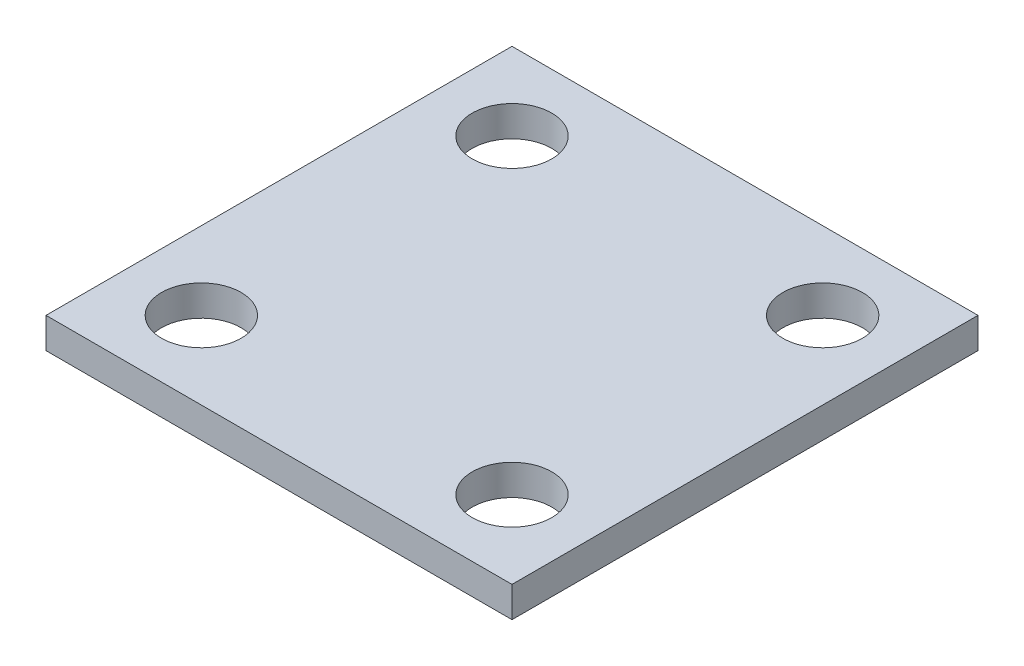
ISO-10303-21;
HEADER;
FILE_DESCRIPTION(('STEP AP214'),'2;1');
FILE_NAME('part.step','',(''),(''),'','','');
FILE_SCHEMA(('AUTOMOTIVE_DESIGN { 1 0 10303 214 1 1 1 1 }'));
ENDSEC;
DATA;
#1=APPLICATION_CONTEXT('core data for automotive mechanical design processes');
#2=APPLICATION_PROTOCOL_DEFINITION('international standard','automotive_design',2000,#1);
#3=PRODUCT_CONTEXT('',#1,'mechanical');
#4=PRODUCT('Part','Part','',(#3));
#5=PRODUCT_RELATED_PRODUCT_CATEGORY('part','',(#4));
#6=PRODUCT_DEFINITION_FORMATION('','',#4);
#7=PRODUCT_DEFINITION_CONTEXT('part definition',#1,'design');
#8=PRODUCT_DEFINITION('design','',#6,#7);
#9=PRODUCT_DEFINITION_SHAPE('','',#8);
#10=(LENGTH_UNIT() NAMED_UNIT(*) SI_UNIT(.MILLI.,.METRE.));
#11=(NAMED_UNIT(*) PLANE_ANGLE_UNIT() SI_UNIT($,.RADIAN.));
#12=(NAMED_UNIT(*) SI_UNIT($,.STERADIAN.) SOLID_ANGLE_UNIT());
#13=UNCERTAINTY_MEASURE_WITH_UNIT(LENGTH_MEASURE(1.E-05),#10,'distance_accuracy_value','');
#14=(GEOMETRIC_REPRESENTATION_CONTEXT(3) GLOBAL_UNCERTAINTY_ASSIGNED_CONTEXT((#13)) GLOBAL_UNIT_ASSIGNED_CONTEXT((#10,
#11,#12)) REPRESENTATION_CONTEXT('',''));
#15=CARTESIAN_POINT('',(0.,0.,0.));
#16=DIRECTION('',(0.,0.,1.));
#17=DIRECTION('',(1.,0.,0.));
#18=AXIS2_PLACEMENT_3D('',#15,#16,#17);
#19=CARTESIAN_POINT('',(0.,2.5,0.));
#20=DIRECTION('',(0.,1.,0.));
#21=DIRECTION('',(0.,0.,1.));
#22=AXIS2_PLACEMENT_3D('',#19,#20,#21);
#23=PLANE('',#22);
#24=CARTESIAN_POINT('',(-12.7,2.5,12.7));
#25=DIRECTION('',(0.,1.,0.));
#26=DIRECTION('',(0.,0.,-1.));
#27=AXIS2_PLACEMENT_3D('',#24,#25,#26);
#28=CIRCLE('',#27,3.25);
#29=CARTESIAN_POINT('',(-12.7,2.5,9.45));
#30=VERTEX_POINT('',#29);
#31=EDGE_CURVE('E131',#30,#30,#28,.T.);
#32=ORIENTED_EDGE('',*,*,#31,.F.);
#33=EDGE_LOOP('',(#32));
#34=FACE_BOUND('',#33,.T.);
#35=CARTESIAN_POINT('',(-12.7,2.5,-12.7));
#36=DIRECTION('',(0.,1.,0.));
#37=DIRECTION('',(0.,0.,1.));
#38=AXIS2_PLACEMENT_3D('',#35,#36,#37);
#39=CIRCLE('',#38,3.25);
#40=CARTESIAN_POINT('',(-12.7,2.5,-9.45));
#41=VERTEX_POINT('',#40);
#42=EDGE_CURVE('E110',#41,#41,#39,.T.);
#43=ORIENTED_EDGE('',*,*,#42,.F.);
#44=EDGE_LOOP('',(#43));
#45=FACE_BOUND('',#44,.T.);
#46=DIRECTION('',(0.,0.,-1.));
#47=VECTOR('',#46,1.);
#48=CARTESIAN_POINT('',(19.05,2.5,-19.05));
#49=LINE('',#48,#47);
#50=CARTESIAN_POINT('',(19.05,2.5,19.05));
#51=VERTEX_POINT('',#50);
#52=CARTESIAN_POINT('',(19.05,2.5,-19.05));
#53=VERTEX_POINT('',#52);
#54=EDGE_CURVE('E95',#51,#53,#49,.T.);
#55=ORIENTED_EDGE('',*,*,#54,.T.);
#56=DIRECTION('',(-1.,0.,0.));
#57=VECTOR('',#56,1.);
#58=CARTESIAN_POINT('',(-19.05,2.5,-19.05));
#59=LINE('',#58,#57);
#60=CARTESIAN_POINT('',(-19.05,2.5,-19.05));
#61=VERTEX_POINT('',#60);
#62=EDGE_CURVE('E90',#53,#61,#59,.T.);
#63=ORIENTED_EDGE('',*,*,#62,.T.);
#64=DIRECTION('',(0.,0.,1.));
#65=VECTOR('',#64,1.);
#66=CARTESIAN_POINT('',(-19.05,2.5,-19.05));
#67=LINE('',#66,#65);
#68=CARTESIAN_POINT('',(-19.05,2.5,19.05));
#69=VERTEX_POINT('',#68);
#70=EDGE_CURVE('E93',#61,#69,#67,.T.);
#71=ORIENTED_EDGE('',*,*,#70,.T.);
#72=DIRECTION('',(1.,0.,0.));
#73=VECTOR('',#72,1.);
#74=CARTESIAN_POINT('',(-19.05,2.5,19.05));
#75=LINE('',#74,#73);
#76=EDGE_CURVE('E60',#69,#51,#75,.T.);
#77=ORIENTED_EDGE('',*,*,#76,.T.);
#78=EDGE_LOOP('',(#55,#63,#71,#77));
#79=FACE_BOUND('',#78,.T.);
#80=CARTESIAN_POINT('',(12.7,2.5,-12.7));
#81=DIRECTION('',(0.,1.,0.));
#82=DIRECTION('',(0.,0.,-1.));
#83=AXIS2_PLACEMENT_3D('',#80,#81,#82);
#84=CIRCLE('',#83,3.25);
#85=CARTESIAN_POINT('',(12.7,2.5,-15.95));
#86=VERTEX_POINT('',#85);
#87=EDGE_CURVE('E125',#86,#86,#84,.T.);
#88=ORIENTED_EDGE('',*,*,#87,.F.);
#89=EDGE_LOOP('',(#88));
#90=FACE_BOUND('',#89,.T.);
#91=CARTESIAN_POINT('',(12.7,2.5,12.7));
#92=DIRECTION('',(0.,1.,0.));
#93=DIRECTION('',(0.,0.,1.));
#94=AXIS2_PLACEMENT_3D('',#91,#92,#93);
#95=CIRCLE('',#94,3.25);
#96=CARTESIAN_POINT('',(12.7,2.5,15.95));
#97=VERTEX_POINT('',#96);
#98=EDGE_CURVE('E137',#97,#97,#95,.T.);
#99=ORIENTED_EDGE('',*,*,#98,.F.);
#100=EDGE_LOOP('',(#99));
#101=FACE_BOUND('',#100,.T.);
#102=ADVANCED_FACE('F43',(#34,#45,#79,#90,#101),#23,.T.);
#103=CARTESIAN_POINT('',(0.,0.,0.));
#104=DIRECTION('',(0.,1.,0.));
#105=DIRECTION('',(0.,0.,1.));
#106=AXIS2_PLACEMENT_3D('',#103,#104,#105);
#107=PLANE('',#106);
#108=DIRECTION('',(0.,0.,-1.));
#109=VECTOR('',#108,1.);
#110=CARTESIAN_POINT('',(19.05,0.,-19.05));
#111=LINE('',#110,#109);
#112=CARTESIAN_POINT('',(19.05,0.,19.05));
#113=VERTEX_POINT('',#112);
#114=CARTESIAN_POINT('',(19.05,0.,-19.05));
#115=VERTEX_POINT('',#114);
#116=EDGE_CURVE('E107',#113,#115,#111,.T.);
#117=ORIENTED_EDGE('',*,*,#116,.F.);
#118=DIRECTION('',(1.,0.,0.));
#119=VECTOR('',#118,1.);
#120=CARTESIAN_POINT('',(-19.05,0.,19.05));
#121=LINE('',#120,#119);
#122=CARTESIAN_POINT('',(-19.05,0.,19.05));
#123=VERTEX_POINT('',#122);
#124=EDGE_CURVE('E83',#123,#113,#121,.T.);
#125=ORIENTED_EDGE('',*,*,#124,.F.);
#126=DIRECTION('',(0.,0.,1.));
#127=VECTOR('',#126,1.);
#128=CARTESIAN_POINT('',(-19.05,0.,-19.05));
#129=LINE('',#128,#127);
#130=CARTESIAN_POINT('',(-19.05,0.,-19.05));
#131=VERTEX_POINT('',#130);
#132=EDGE_CURVE('E77',#131,#123,#129,.T.);
#133=ORIENTED_EDGE('',*,*,#132,.F.);
#134=DIRECTION('',(-1.,0.,0.));
#135=VECTOR('',#134,1.);
#136=CARTESIAN_POINT('',(-19.05,0.,-19.05));
#137=LINE('',#136,#135);
#138=EDGE_CURVE('E99',#115,#131,#137,.T.);
#139=ORIENTED_EDGE('',*,*,#138,.F.);
#140=EDGE_LOOP('',(#117,#125,#133,#139));
#141=FACE_BOUND('',#140,.T.);
#142=CARTESIAN_POINT('',(-12.7,0.,-12.7));
#143=DIRECTION('',(0.,1.,0.));
#144=DIRECTION('',(0.,0.,1.));
#145=AXIS2_PLACEMENT_3D('',#142,#143,#144);
#146=CIRCLE('',#145,3.25);
#147=CARTESIAN_POINT('',(-12.7,0.,-9.45));
#148=VERTEX_POINT('',#147);
#149=EDGE_CURVE('E122',#148,#148,#146,.T.);
#150=ORIENTED_EDGE('',*,*,#149,.T.);
#151=EDGE_LOOP('',(#150));
#152=FACE_BOUND('',#151,.T.);
#153=CARTESIAN_POINT('',(12.7,0.,-12.7));
#154=DIRECTION('',(0.,1.,0.));
#155=DIRECTION('',(0.,0.,-1.));
#156=AXIS2_PLACEMENT_3D('',#153,#154,#155);
#157=CIRCLE('',#156,3.25);
#158=CARTESIAN_POINT('',(12.7,0.,-15.95));
#159=VERTEX_POINT('',#158);
#160=EDGE_CURVE('E128',#159,#159,#157,.T.);
#161=ORIENTED_EDGE('',*,*,#160,.T.);
#162=EDGE_LOOP('',(#161));
#163=FACE_BOUND('',#162,.T.);
#164=CARTESIAN_POINT('',(-12.7,0.,12.7));
#165=DIRECTION('',(0.,1.,0.));
#166=DIRECTION('',(0.,0.,-1.));
#167=AXIS2_PLACEMENT_3D('',#164,#165,#166);
#168=CIRCLE('',#167,3.25);
#169=CARTESIAN_POINT('',(-12.7,0.,9.45));
#170=VERTEX_POINT('',#169);
#171=EDGE_CURVE('E134',#170,#170,#168,.T.);
#172=ORIENTED_EDGE('',*,*,#171,.T.);
#173=EDGE_LOOP('',(#172));
#174=FACE_BOUND('',#173,.T.);
#175=CARTESIAN_POINT('',(12.7,0.,12.7));
#176=DIRECTION('',(0.,1.,0.));
#177=DIRECTION('',(0.,0.,1.));
#178=AXIS2_PLACEMENT_3D('',#175,#176,#177);
#179=CIRCLE('',#178,3.25);
#180=CARTESIAN_POINT('',(12.7,0.,15.95));
#181=VERTEX_POINT('',#180);
#182=EDGE_CURVE('E140',#181,#181,#179,.T.);
#183=ORIENTED_EDGE('',*,*,#182,.T.);
#184=EDGE_LOOP('',(#183));
#185=FACE_BOUND('',#184,.T.);
#186=ADVANCED_FACE('F118',(#141,#152,#163,#174,#185),#107,.F.);
#187=CARTESIAN_POINT('',(19.05,2.5,-19.05));
#188=DIRECTION('',(-1.,0.,0.));
#189=DIRECTION('',(0.,0.,1.));
#190=AXIS2_PLACEMENT_3D('',#187,#188,#189);
#191=PLANE('',#190);
#192=ORIENTED_EDGE('',*,*,#116,.T.);
#193=DIRECTION('',(0.,-1.,0.));
#194=VECTOR('',#193,1.);
#195=CARTESIAN_POINT('',(19.05,2.5,-19.05));
#196=LINE('',#195,#194);
#197=EDGE_CURVE('E11',#53,#115,#196,.T.);
#198=ORIENTED_EDGE('',*,*,#197,.F.);
#199=ORIENTED_EDGE('',*,*,#54,.F.);
#200=DIRECTION('',(0.,-1.,0.));
#201=VECTOR('',#200,1.);
#202=CARTESIAN_POINT('',(19.05,2.5,19.05));
#203=LINE('',#202,#201);
#204=EDGE_CURVE('E103',#51,#113,#203,.T.);
#205=ORIENTED_EDGE('',*,*,#204,.T.);
#206=EDGE_LOOP('',(#192,#198,#199,#205));
#207=FACE_BOUND('',#206,.T.);
#208=ADVANCED_FACE('F45',(#207),#191,.F.);
#209=CARTESIAN_POINT('',(-19.05,2.5,-19.05));
#210=DIRECTION('',(0.,0.,1.));
#211=DIRECTION('',(1.,0.,0.));
#212=AXIS2_PLACEMENT_3D('',#209,#210,#211);
#213=PLANE('',#212);
#214=ORIENTED_EDGE('',*,*,#138,.T.);
#215=DIRECTION('',(0.,-1.,0.));
#216=VECTOR('',#215,1.);
#217=CARTESIAN_POINT('',(-19.05,2.5,-19.05));
#218=LINE('',#217,#216);
#219=EDGE_CURVE('E52',#61,#131,#218,.T.);
#220=ORIENTED_EDGE('',*,*,#219,.F.);
#221=ORIENTED_EDGE('',*,*,#62,.F.);
#222=ORIENTED_EDGE('',*,*,#197,.T.);
#223=EDGE_LOOP('',(#214,#220,#221,#222));
#224=FACE_BOUND('',#223,.T.);
#225=ADVANCED_FACE('F98',(#224),#213,.F.);
#226=CARTESIAN_POINT('',(-19.05,2.5,-19.05));
#227=DIRECTION('',(1.,0.,0.));
#228=DIRECTION('',(0.,0.,-1.));
#229=AXIS2_PLACEMENT_3D('',#226,#227,#228);
#230=PLANE('',#229);
#231=ORIENTED_EDGE('',*,*,#132,.T.);
#232=DIRECTION('',(0.,-1.,0.));
#233=VECTOR('',#232,1.);
#234=CARTESIAN_POINT('',(-19.05,2.5,19.05));
#235=LINE('',#234,#233);
#236=EDGE_CURVE('E100',#69,#123,#235,.T.);
#237=ORIENTED_EDGE('',*,*,#236,.F.);
#238=ORIENTED_EDGE('',*,*,#70,.F.);
#239=ORIENTED_EDGE('',*,*,#219,.T.);
#240=EDGE_LOOP('',(#231,#237,#238,#239));
#241=FACE_BOUND('',#240,.T.);
#242=ADVANCED_FACE('F101',(#241),#230,.F.);
#243=CARTESIAN_POINT('',(-19.05,2.5,19.05));
#244=DIRECTION('',(0.,0.,-1.));
#245=DIRECTION('',(-1.,0.,0.));
#246=AXIS2_PLACEMENT_3D('',#243,#244,#245);
#247=PLANE('',#246);
#248=ORIENTED_EDGE('',*,*,#124,.T.);
#249=ORIENTED_EDGE('',*,*,#204,.F.);
#250=ORIENTED_EDGE('',*,*,#76,.F.);
#251=ORIENTED_EDGE('',*,*,#236,.T.);
#252=EDGE_LOOP('',(#248,#249,#250,#251));
#253=FACE_BOUND('',#252,.T.);
#254=ADVANCED_FACE('F115',(#253),#247,.F.);
#255=CARTESIAN_POINT('',(-12.7,2.5,-12.7));
#256=DIRECTION('',(0.,-1.,0.));
#257=DIRECTION('',(0.,0.,-1.));
#258=AXIS2_PLACEMENT_3D('',#255,#256,#257);
#259=CYLINDRICAL_SURFACE('',#258,3.25);
#260=ORIENTED_EDGE('',*,*,#42,.T.);
#261=EDGE_LOOP('',(#260));
#262=FACE_BOUND('',#261,.T.);
#263=ORIENTED_EDGE('',*,*,#149,.F.);
#264=EDGE_LOOP('',(#263));
#265=FACE_BOUND('',#264,.T.);
#266=ADVANCED_FACE('F159',(#262,#265),#259,.F.);
#267=CARTESIAN_POINT('',(12.7,2.5,-12.7));
#268=DIRECTION('',(0.,-1.,0.));
#269=DIRECTION('',(0.,0.,-1.));
#270=AXIS2_PLACEMENT_3D('',#267,#268,#269);
#271=CYLINDRICAL_SURFACE('',#270,3.25);
#272=ORIENTED_EDGE('',*,*,#87,.T.);
#273=EDGE_LOOP('',(#272));
#274=FACE_BOUND('',#273,.T.);
#275=ORIENTED_EDGE('',*,*,#160,.F.);
#276=EDGE_LOOP('',(#275));
#277=FACE_BOUND('',#276,.T.);
#278=ADVANCED_FACE('F204',(#274,#277),#271,.F.);
#279=CARTESIAN_POINT('',(-12.7,2.5,12.7));
#280=DIRECTION('',(0.,-1.,0.));
#281=DIRECTION('',(0.,0.,-1.));
#282=AXIS2_PLACEMENT_3D('',#279,#280,#281);
#283=CYLINDRICAL_SURFACE('',#282,3.25);
#284=ORIENTED_EDGE('',*,*,#31,.T.);
#285=EDGE_LOOP('',(#284));
#286=FACE_BOUND('',#285,.T.);
#287=ORIENTED_EDGE('',*,*,#171,.F.);
#288=EDGE_LOOP('',(#287));
#289=FACE_BOUND('',#288,.T.);
#290=ADVANCED_FACE('F212',(#286,#289),#283,.F.);
#291=CARTESIAN_POINT('',(12.7,2.5,12.7));
#292=DIRECTION('',(0.,-1.,0.));
#293=DIRECTION('',(0.,0.,-1.));
#294=AXIS2_PLACEMENT_3D('',#291,#292,#293);
#295=CYLINDRICAL_SURFACE('',#294,3.25);
#296=ORIENTED_EDGE('',*,*,#98,.T.);
#297=EDGE_LOOP('',(#296));
#298=FACE_BOUND('',#297,.T.);
#299=ORIENTED_EDGE('',*,*,#182,.F.);
#300=EDGE_LOOP('',(#299));
#301=FACE_BOUND('',#300,.T.);
#302=ADVANCED_FACE('F146',(#298,#301),#295,.F.);
#303=CLOSED_SHELL('',(#102,#186,#208,#225,#242,#254,#266,#278,#290,#302));
#304=MANIFOLD_SOLID_BREP('B2',#303);
#305=ADVANCED_BREP_SHAPE_REPRESENTATION('',(#18,#304),#14);
#306=SHAPE_DEFINITION_REPRESENTATION(#9,#305);
ENDSEC;
END-ISO-10303-21;
